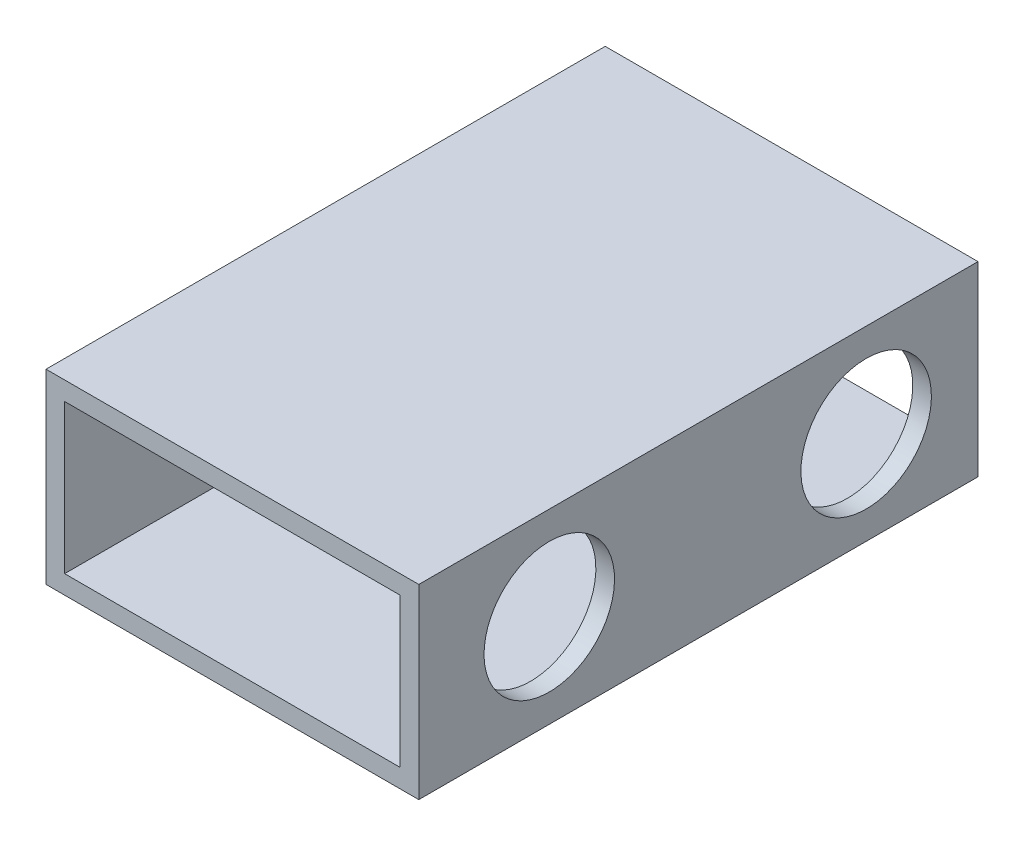
ISO-10303-21;
HEADER;
FILE_DESCRIPTION(('STEP AP214'),'2;1');
FILE_NAME('part.step','',(''),(''),'','','');
FILE_SCHEMA(('AUTOMOTIVE_DESIGN { 1 0 10303 214 1 1 1 1 }'));
ENDSEC;
DATA;
#1=APPLICATION_CONTEXT('core data for automotive mechanical design processes');
#2=APPLICATION_PROTOCOL_DEFINITION('international standard','automotive_design',2000,#1);
#3=PRODUCT_CONTEXT('',#1,'mechanical');
#4=PRODUCT('Part','Part','',(#3));
#5=PRODUCT_RELATED_PRODUCT_CATEGORY('part','',(#4));
#6=PRODUCT_DEFINITION_FORMATION('','',#4);
#7=PRODUCT_DEFINITION_CONTEXT('part definition',#1,'design');
#8=PRODUCT_DEFINITION('design','',#6,#7);
#9=PRODUCT_DEFINITION_SHAPE('','',#8);
#10=(LENGTH_UNIT() NAMED_UNIT(*) SI_UNIT(.MILLI.,.METRE.));
#11=(NAMED_UNIT(*) PLANE_ANGLE_UNIT() SI_UNIT($,.RADIAN.));
#12=(NAMED_UNIT(*) SI_UNIT($,.STERADIAN.) SOLID_ANGLE_UNIT());
#13=UNCERTAINTY_MEASURE_WITH_UNIT(LENGTH_MEASURE(1.E-05),#10,'distance_accuracy_value','');
#14=(GEOMETRIC_REPRESENTATION_CONTEXT(3) GLOBAL_UNCERTAINTY_ASSIGNED_CONTEXT((#13)) GLOBAL_UNIT_ASSIGNED_CONTEXT((#10,
#11,#12)) REPRESENTATION_CONTEXT('',''));
#15=CARTESIAN_POINT('',(0.,0.,0.));
#16=DIRECTION('',(0.,0.,1.));
#17=DIRECTION('',(1.,0.,0.));
#18=AXIS2_PLACEMENT_3D('',#15,#16,#17);
#19=CARTESIAN_POINT('',(0.,0.,30.));
#20=DIRECTION('',(0.,0.,1.));
#21=DIRECTION('',(1.,0.,0.));
#22=AXIS2_PLACEMENT_3D('',#19,#20,#21);
#23=PLANE('',#22);
#24=DIRECTION('',(0.,-1.,0.));
#25=VECTOR('',#24,1.);
#26=CARTESIAN_POINT('',(9.21293609905857,36.3977042356297,30.));
#27=LINE('',#26,#25);
#28=CARTESIAN_POINT('',(9.21293609905857,36.3977042356297,30.));
#29=VERTEX_POINT('',#28);
#30=CARTESIAN_POINT('',(9.21293609905857,26.3977042356297,30.));
#31=VERTEX_POINT('',#30);
#32=EDGE_CURVE('E169',#29,#31,#27,.T.);
#33=ORIENTED_EDGE('',*,*,#32,.T.);
#34=DIRECTION('',(1.,0.,0.));
#35=VECTOR('',#34,1.);
#36=CARTESIAN_POINT('',(9.21293609905857,26.3977042356297,30.));
#37=LINE('',#36,#35);
#38=CARTESIAN_POINT('',(29.2129360990586,26.3977042356297,30.));
#39=VERTEX_POINT('',#38);
#40=EDGE_CURVE('E172',#31,#39,#37,.T.);
#41=ORIENTED_EDGE('',*,*,#40,.T.);
#42=DIRECTION('',(0.,1.,0.));
#43=VECTOR('',#42,1.);
#44=CARTESIAN_POINT('',(29.2129360990586,36.3977042356297,30.));
#45=LINE('',#44,#43);
#46=CARTESIAN_POINT('',(29.2129360990586,36.3977042356297,30.));
#47=VERTEX_POINT('',#46);
#48=EDGE_CURVE('E175',#39,#47,#45,.T.);
#49=ORIENTED_EDGE('',*,*,#48,.T.);
#50=DIRECTION('',(-1.,0.,0.));
#51=VECTOR('',#50,1.);
#52=CARTESIAN_POINT('',(9.21293609905857,36.3977042356297,30.));
#53=LINE('',#52,#51);
#54=EDGE_CURVE('E177',#47,#29,#53,.T.);
#55=ORIENTED_EDGE('',*,*,#54,.T.);
#56=EDGE_LOOP('',(#33,#41,#49,#55));
#57=FACE_BOUND('',#56,.T.);
#58=DIRECTION('',(1.,0.,0.));
#59=VECTOR('',#58,1.);
#60=CARTESIAN_POINT('',(9.21293609905857,27.3977042356297,30.));
#61=LINE('',#60,#59);
#62=CARTESIAN_POINT('',(10.2129360990586,27.3977042356297,30.));
#63=VERTEX_POINT('',#62);
#64=CARTESIAN_POINT('',(28.2129360990586,27.3977042356297,30.));
#65=VERTEX_POINT('',#64);
#66=EDGE_CURVE('E139',#63,#65,#61,.T.);
#67=ORIENTED_EDGE('',*,*,#66,.F.);
#68=DIRECTION('',(0.,-1.,0.));
#69=VECTOR('',#68,1.);
#70=CARTESIAN_POINT('',(10.2129360990586,36.3977042356297,30.));
#71=LINE('',#70,#69);
#72=CARTESIAN_POINT('',(10.2129360990586,35.3977042356297,30.));
#73=VERTEX_POINT('',#72);
#74=EDGE_CURVE('E131',#73,#63,#71,.T.);
#75=ORIENTED_EDGE('',*,*,#74,.F.);
#76=DIRECTION('',(-1.,0.,0.));
#77=VECTOR('',#76,1.);
#78=CARTESIAN_POINT('',(9.21293609905857,35.3977042356297,30.));
#79=LINE('',#78,#77);
#80=CARTESIAN_POINT('',(28.2129360990586,35.3977042356297,30.));
#81=VERTEX_POINT('',#80);
#82=EDGE_CURVE('E153',#81,#73,#79,.T.);
#83=ORIENTED_EDGE('',*,*,#82,.F.);
#84=DIRECTION('',(0.,1.,0.));
#85=VECTOR('',#84,1.);
#86=CARTESIAN_POINT('',(28.2129360990586,36.3977042356297,30.));
#87=LINE('',#86,#85);
#88=EDGE_CURVE('E151',#65,#81,#87,.T.);
#89=ORIENTED_EDGE('',*,*,#88,.F.);
#90=EDGE_LOOP('',(#67,#75,#83,#89));
#91=FACE_BOUND('',#90,.T.);
#92=ADVANCED_FACE('F64',(#57,#91),#23,.T.);
#93=CARTESIAN_POINT('',(0.,0.,0.));
#94=DIRECTION('',(0.,0.,1.));
#95=DIRECTION('',(1.,0.,0.));
#96=AXIS2_PLACEMENT_3D('',#93,#94,#95);
#97=PLANE('',#96);
#98=DIRECTION('',(0.,-1.,0.));
#99=VECTOR('',#98,1.);
#100=CARTESIAN_POINT('',(9.21293609905857,36.3977042356297,0.));
#101=LINE('',#100,#99);
#102=CARTESIAN_POINT('',(9.21293609905857,36.3977042356297,0.));
#103=VERTEX_POINT('',#102);
#104=CARTESIAN_POINT('',(9.21293609905857,26.3977042356297,0.));
#105=VERTEX_POINT('',#104);
#106=EDGE_CURVE('E147',#103,#105,#101,.T.);
#107=ORIENTED_EDGE('',*,*,#106,.F.);
#108=DIRECTION('',(-1.,0.,0.));
#109=VECTOR('',#108,1.);
#110=CARTESIAN_POINT('',(9.21293609905857,36.3977042356297,0.));
#111=LINE('',#110,#109);
#112=CARTESIAN_POINT('',(29.2129360990586,36.3977042356297,0.));
#113=VERTEX_POINT('',#112);
#114=EDGE_CURVE('E173',#113,#103,#111,.T.);
#115=ORIENTED_EDGE('',*,*,#114,.F.);
#116=DIRECTION('',(0.,1.,0.));
#117=VECTOR('',#116,1.);
#118=CARTESIAN_POINT('',(29.2129360990586,36.3977042356297,0.));
#119=LINE('',#118,#117);
#120=CARTESIAN_POINT('',(29.2129360990586,26.3977042356297,0.));
#121=VERTEX_POINT('',#120);
#122=EDGE_CURVE('E184',#121,#113,#119,.T.);
#123=ORIENTED_EDGE('',*,*,#122,.F.);
#124=DIRECTION('',(1.,0.,0.));
#125=VECTOR('',#124,1.);
#126=CARTESIAN_POINT('',(9.21293609905857,26.3977042356297,0.));
#127=LINE('',#126,#125);
#128=EDGE_CURVE('E182',#105,#121,#127,.T.);
#129=ORIENTED_EDGE('',*,*,#128,.F.);
#130=EDGE_LOOP('',(#107,#115,#123,#129));
#131=FACE_BOUND('',#130,.T.);
#132=DIRECTION('',(0.,-1.,0.));
#133=VECTOR('',#132,1.);
#134=CARTESIAN_POINT('',(10.2129360990586,36.3977042356297,0.));
#135=LINE('',#134,#133);
#136=CARTESIAN_POINT('',(10.2129360990586,35.3977042356297,0.));
#137=VERTEX_POINT('',#136);
#138=CARTESIAN_POINT('',(10.2129360990586,27.3977042356297,0.));
#139=VERTEX_POINT('',#138);
#140=EDGE_CURVE('E89',#137,#139,#135,.T.);
#141=ORIENTED_EDGE('',*,*,#140,.T.);
#142=DIRECTION('',(1.,0.,0.));
#143=VECTOR('',#142,1.);
#144=CARTESIAN_POINT('',(9.21293609905857,27.3977042356297,0.));
#145=LINE('',#144,#143);
#146=CARTESIAN_POINT('',(28.2129360990586,27.3977042356297,0.));
#147=VERTEX_POINT('',#146);
#148=EDGE_CURVE('E146',#139,#147,#145,.T.);
#149=ORIENTED_EDGE('',*,*,#148,.T.);
#150=DIRECTION('',(0.,1.,0.));
#151=VECTOR('',#150,1.);
#152=CARTESIAN_POINT('',(28.2129360990586,36.3977042356297,0.));
#153=LINE('',#152,#151);
#154=CARTESIAN_POINT('',(28.2129360990586,35.3977042356297,0.));
#155=VERTEX_POINT('',#154);
#156=EDGE_CURVE('E161',#147,#155,#153,.T.);
#157=ORIENTED_EDGE('',*,*,#156,.T.);
#158=DIRECTION('',(-1.,0.,0.));
#159=VECTOR('',#158,1.);
#160=CARTESIAN_POINT('',(9.21293609905857,35.3977042356297,0.));
#161=LINE('',#160,#159);
#162=EDGE_CURVE('E140',#155,#137,#161,.T.);
#163=ORIENTED_EDGE('',*,*,#162,.T.);
#164=EDGE_LOOP('',(#141,#149,#157,#163));
#165=FACE_BOUND('',#164,.T.);
#166=ADVANCED_FACE('F237',(#131,#165),#97,.F.);
#167=CARTESIAN_POINT('',(9.21293609905857,36.3977042356297,30.));
#168=DIRECTION('',(1.,0.,0.));
#169=DIRECTION('',(0.,0.,-1.));
#170=AXIS2_PLACEMENT_3D('',#167,#168,#169);
#171=PLANE('',#170);
#172=CARTESIAN_POINT('',(9.21293609905859,31.3977042356297,23.));
#173=DIRECTION('',(1.,0.,0.));
#174=DIRECTION('',(0.,1.,0.));
#175=AXIS2_PLACEMENT_3D('',#172,#173,#174);
#176=CIRCLE('',#175,1.5);
#177=CARTESIAN_POINT('',(9.21293609905859,32.8977042356297,23.));
#178=VERTEX_POINT('',#177);
#179=EDGE_CURVE('E208',#178,#178,#176,.T.);
#180=ORIENTED_EDGE('',*,*,#179,.T.);
#181=EDGE_LOOP('',(#180));
#182=FACE_BOUND('',#181,.T.);
#183=CARTESIAN_POINT('',(9.21293609905859,31.3977042356297,6.));
#184=DIRECTION('',(1.,0.,0.));
#185=DIRECTION('',(0.,1.,0.));
#186=AXIS2_PLACEMENT_3D('',#183,#184,#185);
#187=CIRCLE('',#186,1.5);
#188=CARTESIAN_POINT('',(9.21293609905859,32.8977042356297,6.));
#189=VERTEX_POINT('',#188);
#190=EDGE_CURVE('E199',#189,#189,#187,.T.);
#191=ORIENTED_EDGE('',*,*,#190,.T.);
#192=EDGE_LOOP('',(#191));
#193=FACE_BOUND('',#192,.T.);
#194=ORIENTED_EDGE('',*,*,#106,.T.);
#195=DIRECTION('',(0.,0.,-1.));
#196=VECTOR('',#195,1.);
#197=CARTESIAN_POINT('',(9.21293609905857,26.3977042356297,30.));
#198=LINE('',#197,#196);
#199=EDGE_CURVE('E12',#31,#105,#198,.T.);
#200=ORIENTED_EDGE('',*,*,#199,.F.);
#201=ORIENTED_EDGE('',*,*,#32,.F.);
#202=DIRECTION('',(0.,0.,-1.));
#203=VECTOR('',#202,1.);
#204=CARTESIAN_POINT('',(9.21293609905857,36.3977042356297,30.));
#205=LINE('',#204,#203);
#206=EDGE_CURVE('E179',#29,#103,#205,.T.);
#207=ORIENTED_EDGE('',*,*,#206,.T.);
#208=EDGE_LOOP('',(#194,#200,#201,#207));
#209=FACE_BOUND('',#208,.T.);
#210=ADVANCED_FACE('F66',(#182,#193,#209),#171,.F.);
#211=CARTESIAN_POINT('',(9.21293609905857,26.3977042356297,30.));
#212=DIRECTION('',(0.,1.,0.));
#213=DIRECTION('',(0.,0.,1.));
#214=AXIS2_PLACEMENT_3D('',#211,#212,#213);
#215=PLANE('',#214);
#216=ORIENTED_EDGE('',*,*,#128,.T.);
#217=DIRECTION('',(0.,0.,-1.));
#218=VECTOR('',#217,1.);
#219=CARTESIAN_POINT('',(29.2129360990586,26.3977042356297,30.));
#220=LINE('',#219,#218);
#221=EDGE_CURVE('E73',#39,#121,#220,.T.);
#222=ORIENTED_EDGE('',*,*,#221,.F.);
#223=ORIENTED_EDGE('',*,*,#40,.F.);
#224=ORIENTED_EDGE('',*,*,#199,.T.);
#225=EDGE_LOOP('',(#216,#222,#223,#224));
#226=FACE_BOUND('',#225,.T.);
#227=ADVANCED_FACE('F236',(#226),#215,.F.);
#228=CARTESIAN_POINT('',(29.2129360990586,36.3977042356297,30.));
#229=DIRECTION('',(-1.,0.,0.));
#230=DIRECTION('',(0.,0.,1.));
#231=AXIS2_PLACEMENT_3D('',#228,#229,#230);
#232=PLANE('',#231);
#233=CARTESIAN_POINT('',(29.2129360990586,31.3977042356297,23.));
#234=DIRECTION('',(1.,0.,0.));
#235=DIRECTION('',(0.,1.,0.));
#236=AXIS2_PLACEMENT_3D('',#233,#234,#235);
#237=CIRCLE('',#236,3.5);
#238=CARTESIAN_POINT('',(29.2129360990586,34.8977042356297,23.));
#239=VERTEX_POINT('',#238);
#240=EDGE_CURVE('E195',#239,#239,#237,.T.);
#241=ORIENTED_EDGE('',*,*,#240,.F.);
#242=EDGE_LOOP('',(#241));
#243=FACE_BOUND('',#242,.T.);
#244=CARTESIAN_POINT('',(29.2129360990586,31.3977042356297,6.));
#245=DIRECTION('',(1.,0.,0.));
#246=DIRECTION('',(0.,1.,0.));
#247=AXIS2_PLACEMENT_3D('',#244,#245,#246);
#248=CIRCLE('',#247,3.5);
#249=CARTESIAN_POINT('',(29.2129360990586,34.8977042356297,6.));
#250=VERTEX_POINT('',#249);
#251=EDGE_CURVE('E201',#250,#250,#248,.T.);
#252=ORIENTED_EDGE('',*,*,#251,.F.);
#253=EDGE_LOOP('',(#252));
#254=FACE_BOUND('',#253,.T.);
#255=ORIENTED_EDGE('',*,*,#122,.T.);
#256=DIRECTION('',(0.,0.,-1.));
#257=VECTOR('',#256,1.);
#258=CARTESIAN_POINT('',(29.2129360990586,36.3977042356297,30.));
#259=LINE('',#258,#257);
#260=EDGE_CURVE('E189',#47,#113,#259,.T.);
#261=ORIENTED_EDGE('',*,*,#260,.F.);
#262=ORIENTED_EDGE('',*,*,#48,.F.);
#263=ORIENTED_EDGE('',*,*,#221,.T.);
#264=EDGE_LOOP('',(#255,#261,#262,#263));
#265=FACE_BOUND('',#264,.T.);
#266=ADVANCED_FACE('F255',(#243,#254,#265),#232,.F.);
#267=CARTESIAN_POINT('',(9.21293609905857,36.3977042356297,30.));
#268=DIRECTION('',(0.,-1.,0.));
#269=DIRECTION('',(0.,0.,-1.));
#270=AXIS2_PLACEMENT_3D('',#267,#268,#269);
#271=PLANE('',#270);
#272=ORIENTED_EDGE('',*,*,#114,.T.);
#273=ORIENTED_EDGE('',*,*,#206,.F.);
#274=ORIENTED_EDGE('',*,*,#54,.F.);
#275=ORIENTED_EDGE('',*,*,#260,.T.);
#276=EDGE_LOOP('',(#272,#273,#274,#275));
#277=FACE_BOUND('',#276,.T.);
#278=ADVANCED_FACE('F223',(#277),#271,.F.);
#279=CARTESIAN_POINT('',(10.2129360990586,36.3977042356297,30.));
#280=DIRECTION('',(1.,0.,0.));
#281=DIRECTION('',(0.,0.,-1.));
#282=AXIS2_PLACEMENT_3D('',#279,#280,#281);
#283=PLANE('',#282);
#284=CARTESIAN_POINT('',(10.2129360990586,31.3977042356297,23.));
#285=DIRECTION('',(1.,0.,0.));
#286=DIRECTION('',(0.,0.,-1.));
#287=AXIS2_PLACEMENT_3D('',#284,#285,#286);
#288=CIRCLE('',#287,1.5);
#289=CARTESIAN_POINT('',(10.2129360990586,31.3977042356297,21.5));
#290=VERTEX_POINT('',#289);
#291=EDGE_CURVE('E159',#290,#290,#288,.T.);
#292=ORIENTED_EDGE('',*,*,#291,.F.);
#293=EDGE_LOOP('',(#292));
#294=FACE_BOUND('',#293,.T.);
#295=CARTESIAN_POINT('',(10.2129360990586,31.3977042356297,6.));
#296=DIRECTION('',(1.,0.,0.));
#297=DIRECTION('',(0.,0.,-1.));
#298=AXIS2_PLACEMENT_3D('',#295,#296,#297);
#299=CIRCLE('',#298,1.5);
#300=CARTESIAN_POINT('',(10.2129360990586,31.3977042356297,4.5));
#301=VERTEX_POINT('',#300);
#302=EDGE_CURVE('E211',#301,#301,#299,.T.);
#303=ORIENTED_EDGE('',*,*,#302,.F.);
#304=EDGE_LOOP('',(#303));
#305=FACE_BOUND('',#304,.T.);
#306=ORIENTED_EDGE('',*,*,#140,.F.);
#307=DIRECTION('',(0.,0.,-1.));
#308=VECTOR('',#307,1.);
#309=CARTESIAN_POINT('',(10.2129360990586,35.3977042356297,30.));
#310=LINE('',#309,#308);
#311=EDGE_CURVE('E135',#73,#137,#310,.T.);
#312=ORIENTED_EDGE('',*,*,#311,.F.);
#313=ORIENTED_EDGE('',*,*,#74,.T.);
#314=DIRECTION('',(0.,0.,-1.));
#315=VECTOR('',#314,1.);
#316=CARTESIAN_POINT('',(10.2129360990586,27.3977042356297,30.));
#317=LINE('',#316,#315);
#318=EDGE_CURVE('E134',#63,#139,#317,.T.);
#319=ORIENTED_EDGE('',*,*,#318,.T.);
#320=EDGE_LOOP('',(#306,#312,#313,#319));
#321=FACE_BOUND('',#320,.T.);
#322=ADVANCED_FACE('F133',(#294,#305,#321),#283,.T.);
#323=CARTESIAN_POINT('',(9.21293609905857,27.3977042356297,30.));
#324=DIRECTION('',(0.,1.,0.));
#325=DIRECTION('',(0.,0.,1.));
#326=AXIS2_PLACEMENT_3D('',#323,#324,#325);
#327=PLANE('',#326);
#328=ORIENTED_EDGE('',*,*,#148,.F.);
#329=ORIENTED_EDGE('',*,*,#318,.F.);
#330=ORIENTED_EDGE('',*,*,#66,.T.);
#331=DIRECTION('',(0.,0.,-1.));
#332=VECTOR('',#331,1.);
#333=CARTESIAN_POINT('',(28.2129360990586,27.3977042356297,30.));
#334=LINE('',#333,#332);
#335=EDGE_CURVE('E148',#65,#147,#334,.T.);
#336=ORIENTED_EDGE('',*,*,#335,.T.);
#337=EDGE_LOOP('',(#328,#329,#330,#336));
#338=FACE_BOUND('',#337,.T.);
#339=ADVANCED_FACE('F143',(#338),#327,.T.);
#340=CARTESIAN_POINT('',(28.2129360990586,36.3977042356297,30.));
#341=DIRECTION('',(-1.,0.,0.));
#342=DIRECTION('',(0.,0.,1.));
#343=AXIS2_PLACEMENT_3D('',#340,#341,#342);
#344=PLANE('',#343);
#345=CARTESIAN_POINT('',(28.2129360990586,31.3977042356297,23.));
#346=DIRECTION('',(-1.,0.,0.));
#347=DIRECTION('',(0.,0.,1.));
#348=AXIS2_PLACEMENT_3D('',#345,#346,#347);
#349=CIRCLE('',#348,3.5);
#350=CARTESIAN_POINT('',(28.2129360990586,31.3977042356297,26.5));
#351=VERTEX_POINT('',#350);
#352=EDGE_CURVE('E68',#351,#351,#349,.T.);
#353=ORIENTED_EDGE('',*,*,#352,.F.);
#354=EDGE_LOOP('',(#353));
#355=FACE_BOUND('',#354,.T.);
#356=CARTESIAN_POINT('',(28.2129360990586,31.3977042356297,6.));
#357=DIRECTION('',(-1.,0.,0.));
#358=DIRECTION('',(0.,0.,1.));
#359=AXIS2_PLACEMENT_3D('',#356,#357,#358);
#360=CIRCLE('',#359,3.5);
#361=CARTESIAN_POINT('',(28.2129360990586,31.3977042356297,9.5));
#362=VERTEX_POINT('',#361);
#363=EDGE_CURVE('E193',#362,#362,#360,.T.);
#364=ORIENTED_EDGE('',*,*,#363,.F.);
#365=EDGE_LOOP('',(#364));
#366=FACE_BOUND('',#365,.T.);
#367=ORIENTED_EDGE('',*,*,#156,.F.);
#368=ORIENTED_EDGE('',*,*,#335,.F.);
#369=ORIENTED_EDGE('',*,*,#88,.T.);
#370=DIRECTION('',(0.,0.,-1.));
#371=VECTOR('',#370,1.);
#372=CARTESIAN_POINT('',(28.2129360990586,35.3977042356297,30.));
#373=LINE('',#372,#371);
#374=EDGE_CURVE('E81',#81,#155,#373,.T.);
#375=ORIENTED_EDGE('',*,*,#374,.T.);
#376=EDGE_LOOP('',(#367,#368,#369,#375));
#377=FACE_BOUND('',#376,.T.);
#378=ADVANCED_FACE('F274',(#355,#366,#377),#344,.T.);
#379=CARTESIAN_POINT('',(9.21293609905857,35.3977042356297,30.));
#380=DIRECTION('',(0.,-1.,0.));
#381=DIRECTION('',(0.,0.,-1.));
#382=AXIS2_PLACEMENT_3D('',#379,#380,#381);
#383=PLANE('',#382);
#384=ORIENTED_EDGE('',*,*,#162,.F.);
#385=ORIENTED_EDGE('',*,*,#374,.F.);
#386=ORIENTED_EDGE('',*,*,#82,.T.);
#387=ORIENTED_EDGE('',*,*,#311,.T.);
#388=EDGE_LOOP('',(#384,#385,#386,#387));
#389=FACE_BOUND('',#388,.T.);
#390=ADVANCED_FACE('F230',(#389),#383,.T.);
#391=CARTESIAN_POINT('',(9.21293609905859,31.3977042356297,6.));
#392=DIRECTION('',(1.,0.,0.));
#393=DIRECTION('',(0.,1.,0.));
#394=AXIS2_PLACEMENT_3D('',#391,#392,#393);
#395=CYLINDRICAL_SURFACE('',#394,1.5);
#396=ORIENTED_EDGE('',*,*,#302,.T.);
#397=EDGE_LOOP('',(#396));
#398=FACE_BOUND('',#397,.T.);
#399=ORIENTED_EDGE('',*,*,#190,.F.);
#400=EDGE_LOOP('',(#399));
#401=FACE_BOUND('',#400,.T.);
#402=ADVANCED_FACE('F227',(#398,#401),#395,.F.);
#403=CARTESIAN_POINT('',(9.21293609905859,31.3977042356297,23.));
#404=DIRECTION('',(1.,0.,0.));
#405=DIRECTION('',(0.,1.,0.));
#406=AXIS2_PLACEMENT_3D('',#403,#404,#405);
#407=CYLINDRICAL_SURFACE('',#406,1.5);
#408=ORIENTED_EDGE('',*,*,#291,.T.);
#409=EDGE_LOOP('',(#408));
#410=FACE_BOUND('',#409,.T.);
#411=ORIENTED_EDGE('',*,*,#179,.F.);
#412=EDGE_LOOP('',(#411));
#413=FACE_BOUND('',#412,.T.);
#414=ADVANCED_FACE('F218',(#410,#413),#407,.F.);
#415=CARTESIAN_POINT('',(24.2129360990586,31.3977042356297,6.));
#416=DIRECTION('',(1.,0.,0.));
#417=DIRECTION('',(0.,1.,0.));
#418=AXIS2_PLACEMENT_3D('',#415,#416,#417);
#419=CYLINDRICAL_SURFACE('',#418,3.5);
#420=ORIENTED_EDGE('',*,*,#363,.T.);
#421=EDGE_LOOP('',(#420));
#422=FACE_BOUND('',#421,.T.);
#423=ORIENTED_EDGE('',*,*,#251,.T.);
#424=EDGE_LOOP('',(#423));
#425=FACE_BOUND('',#424,.T.);
#426=ADVANCED_FACE('F282',(#422,#425),#419,.F.);
#427=CARTESIAN_POINT('',(24.2129360990586,31.3977042356297,23.));
#428=DIRECTION('',(1.,0.,0.));
#429=DIRECTION('',(0.,1.,0.));
#430=AXIS2_PLACEMENT_3D('',#427,#428,#429);
#431=CYLINDRICAL_SURFACE('',#430,3.5);
#432=ORIENTED_EDGE('',*,*,#352,.T.);
#433=EDGE_LOOP('',(#432));
#434=FACE_BOUND('',#433,.T.);
#435=ORIENTED_EDGE('',*,*,#240,.T.);
#436=EDGE_LOOP('',(#435));
#437=FACE_BOUND('',#436,.T.);
#438=ADVANCED_FACE('F285',(#434,#437),#431,.F.);
#439=CLOSED_SHELL('',(#92,#166,#210,#227,#266,#278,#322,#339,#378,#390,#402,#414,#426,#438));
#440=MANIFOLD_SOLID_BREP('B2',#439);
#441=ADVANCED_BREP_SHAPE_REPRESENTATION('',(#18,#440),#14);
#442=SHAPE_DEFINITION_REPRESENTATION(#9,#441);
ENDSEC;
END-ISO-10303-21;
